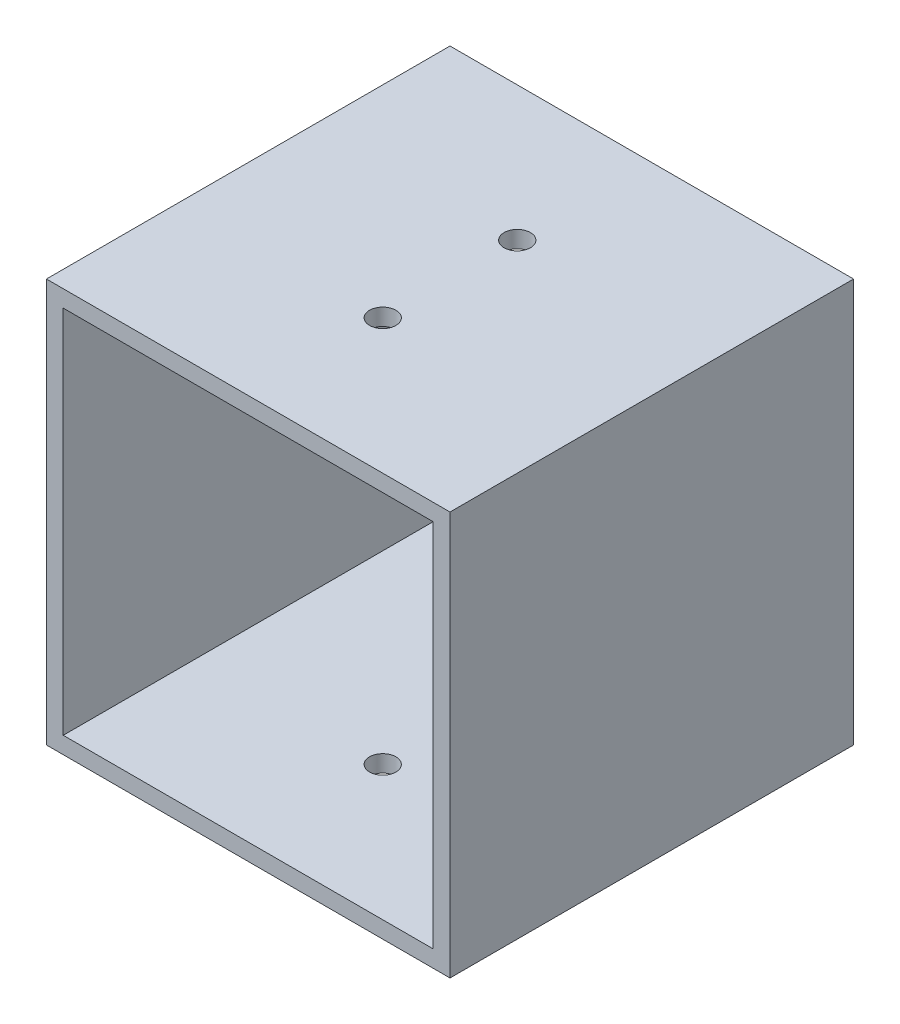
ISO-10303-21;
HEADER;
FILE_DESCRIPTION(('STEP AP214'),'2;1');
FILE_NAME('part.step','',(''),(''),'','','');
FILE_SCHEMA(('AUTOMOTIVE_DESIGN { 1 0 10303 214 1 1 1 1 }'));
ENDSEC;
DATA;
#1=APPLICATION_CONTEXT('core data for automotive mechanical design processes');
#2=APPLICATION_PROTOCOL_DEFINITION('international standard','automotive_design',2000,#1);
#3=PRODUCT_CONTEXT('',#1,'mechanical');
#4=PRODUCT('Part','Part','',(#3));
#5=PRODUCT_RELATED_PRODUCT_CATEGORY('part','',(#4));
#6=PRODUCT_DEFINITION_FORMATION('','',#4);
#7=PRODUCT_DEFINITION_CONTEXT('part definition',#1,'design');
#8=PRODUCT_DEFINITION('design','',#6,#7);
#9=PRODUCT_DEFINITION_SHAPE('','',#8);
#10=(LENGTH_UNIT() NAMED_UNIT(*) SI_UNIT(.MILLI.,.METRE.));
#11=(NAMED_UNIT(*) PLANE_ANGLE_UNIT() SI_UNIT($,.RADIAN.));
#12=(NAMED_UNIT(*) SI_UNIT($,.STERADIAN.) SOLID_ANGLE_UNIT());
#13=UNCERTAINTY_MEASURE_WITH_UNIT(LENGTH_MEASURE(1.E-05),#10,'distance_accuracy_value','');
#14=(GEOMETRIC_REPRESENTATION_CONTEXT(3) GLOBAL_UNCERTAINTY_ASSIGNED_CONTEXT((#13)) GLOBAL_UNIT_ASSIGNED_CONTEXT((#10,
#11,#12)) REPRESENTATION_CONTEXT('',''));
#15=CARTESIAN_POINT('',(0.,0.,0.));
#16=DIRECTION('',(0.,0.,1.));
#17=DIRECTION('',(1.,0.,0.));
#18=AXIS2_PLACEMENT_3D('',#15,#16,#17);
#19=CARTESIAN_POINT('',(0.,0.,38.1));
#20=DIRECTION('',(0.,0.,1.));
#21=DIRECTION('',(1.,0.,0.));
#22=AXIS2_PLACEMENT_3D('',#19,#20,#21);
#23=PLANE('',#22);
#24=DIRECTION('',(0.,1.,0.));
#25=VECTOR('',#24,1.);
#26=CARTESIAN_POINT('',(38.1,-38.1,38.1));
#27=LINE('',#26,#25);
#28=CARTESIAN_POINT('',(38.1,-38.1,38.1));
#29=VERTEX_POINT('',#28);
#30=CARTESIAN_POINT('',(38.1,38.1,38.1));
#31=VERTEX_POINT('',#30);
#32=EDGE_CURVE('E179',#29,#31,#27,.T.);
#33=ORIENTED_EDGE('',*,*,#32,.T.);
#34=DIRECTION('',(-1.,0.,0.));
#35=VECTOR('',#34,1.);
#36=CARTESIAN_POINT('',(-38.1,38.1,38.1));
#37=LINE('',#36,#35);
#38=CARTESIAN_POINT('',(-38.1,38.1,38.1));
#39=VERTEX_POINT('',#38);
#40=EDGE_CURVE('E183',#31,#39,#37,.T.);
#41=ORIENTED_EDGE('',*,*,#40,.T.);
#42=DIRECTION('',(0.,-1.,0.));
#43=VECTOR('',#42,1.);
#44=CARTESIAN_POINT('',(-38.1,-38.1,38.1));
#45=LINE('',#44,#43);
#46=CARTESIAN_POINT('',(-38.1,-38.1,38.1));
#47=VERTEX_POINT('',#46);
#48=EDGE_CURVE('E187',#39,#47,#45,.T.);
#49=ORIENTED_EDGE('',*,*,#48,.T.);
#50=DIRECTION('',(1.,0.,0.));
#51=VECTOR('',#50,1.);
#52=CARTESIAN_POINT('',(-38.1,-38.1,38.1));
#53=LINE('',#52,#51);
#54=EDGE_CURVE('E190',#47,#29,#53,.T.);
#55=ORIENTED_EDGE('',*,*,#54,.T.);
#56=EDGE_LOOP('',(#33,#41,#49,#55));
#57=FACE_BOUND('',#56,.T.);
#58=DIRECTION('',(-1.,0.,0.));
#59=VECTOR('',#58,1.);
#60=CARTESIAN_POINT('',(0.,34.925,38.1));
#61=LINE('',#60,#59);
#62=CARTESIAN_POINT('',(34.925,34.925,38.1));
#63=VERTEX_POINT('',#62);
#64=CARTESIAN_POINT('',(-34.925,34.925,38.1));
#65=VERTEX_POINT('',#64);
#66=EDGE_CURVE('E138',#63,#65,#61,.T.);
#67=ORIENTED_EDGE('',*,*,#66,.F.);
#68=DIRECTION('',(0.,1.,0.));
#69=VECTOR('',#68,1.);
#70=CARTESIAN_POINT('',(34.925,0.,38.1));
#71=LINE('',#70,#69);
#72=CARTESIAN_POINT('',(34.925,-34.925,38.1));
#73=VERTEX_POINT('',#72);
#74=EDGE_CURVE('E129',#73,#63,#71,.T.);
#75=ORIENTED_EDGE('',*,*,#74,.F.);
#76=DIRECTION('',(1.,0.,0.));
#77=VECTOR('',#76,1.);
#78=CARTESIAN_POINT('',(0.,-34.925,38.1));
#79=LINE('',#78,#77);
#80=CARTESIAN_POINT('',(-34.925,-34.925,38.1));
#81=VERTEX_POINT('',#80);
#82=EDGE_CURVE('E155',#81,#73,#79,.T.);
#83=ORIENTED_EDGE('',*,*,#82,.F.);
#84=DIRECTION('',(0.,-1.,0.));
#85=VECTOR('',#84,1.);
#86=CARTESIAN_POINT('',(-34.925,0.,38.1));
#87=LINE('',#86,#85);
#88=EDGE_CURVE('E151',#65,#81,#87,.T.);
#89=ORIENTED_EDGE('',*,*,#88,.F.);
#90=EDGE_LOOP('',(#67,#75,#83,#89));
#91=FACE_BOUND('',#90,.T.);
#92=ADVANCED_FACE('F61',(#57,#91),#23,.T.);
#93=CARTESIAN_POINT('',(0.,0.,-38.1));
#94=DIRECTION('',(0.,0.,1.));
#95=DIRECTION('',(1.,0.,0.));
#96=AXIS2_PLACEMENT_3D('',#93,#94,#95);
#97=PLANE('',#96);
#98=DIRECTION('',(0.,1.,0.));
#99=VECTOR('',#98,1.);
#100=CARTESIAN_POINT('',(38.1,-38.1,-38.1));
#101=LINE('',#100,#99);
#102=CARTESIAN_POINT('',(38.1,-38.1,-38.1));
#103=VERTEX_POINT('',#102);
#104=CARTESIAN_POINT('',(38.1,38.1,-38.1));
#105=VERTEX_POINT('',#104);
#106=EDGE_CURVE('E147',#103,#105,#101,.T.);
#107=ORIENTED_EDGE('',*,*,#106,.F.);
#108=DIRECTION('',(1.,0.,0.));
#109=VECTOR('',#108,1.);
#110=CARTESIAN_POINT('',(-38.1,-38.1,-38.1));
#111=LINE('',#110,#109);
#112=CARTESIAN_POINT('',(-38.1,-38.1,-38.1));
#113=VERTEX_POINT('',#112);
#114=EDGE_CURVE('E184',#113,#103,#111,.T.);
#115=ORIENTED_EDGE('',*,*,#114,.F.);
#116=DIRECTION('',(0.,-1.,0.));
#117=VECTOR('',#116,1.);
#118=CARTESIAN_POINT('',(-38.1,-38.1,-38.1));
#119=LINE('',#118,#117);
#120=CARTESIAN_POINT('',(-38.1,38.1,-38.1));
#121=VERTEX_POINT('',#120);
#122=EDGE_CURVE('E200',#121,#113,#119,.T.);
#123=ORIENTED_EDGE('',*,*,#122,.F.);
#124=DIRECTION('',(-1.,0.,0.));
#125=VECTOR('',#124,1.);
#126=CARTESIAN_POINT('',(-38.1,38.1,-38.1));
#127=LINE('',#126,#125);
#128=EDGE_CURVE('E197',#105,#121,#127,.T.);
#129=ORIENTED_EDGE('',*,*,#128,.F.);
#130=EDGE_LOOP('',(#107,#115,#123,#129));
#131=FACE_BOUND('',#130,.T.);
#132=DIRECTION('',(0.,1.,0.));
#133=VECTOR('',#132,1.);
#134=CARTESIAN_POINT('',(34.925,0.,-38.1));
#135=LINE('',#134,#133);
#136=CARTESIAN_POINT('',(34.925,-34.925,-38.1));
#137=VERTEX_POINT('',#136);
#138=CARTESIAN_POINT('',(34.925,34.925,-38.1));
#139=VERTEX_POINT('',#138);
#140=EDGE_CURVE('E87',#137,#139,#135,.T.);
#141=ORIENTED_EDGE('',*,*,#140,.T.);
#142=DIRECTION('',(-1.,0.,0.));
#143=VECTOR('',#142,1.);
#144=CARTESIAN_POINT('',(0.,34.925,-38.1));
#145=LINE('',#144,#143);
#146=CARTESIAN_POINT('',(-34.925,34.925,-38.1));
#147=VERTEX_POINT('',#146);
#148=EDGE_CURVE('E145',#139,#147,#145,.T.);
#149=ORIENTED_EDGE('',*,*,#148,.T.);
#150=DIRECTION('',(0.,-1.,0.));
#151=VECTOR('',#150,1.);
#152=CARTESIAN_POINT('',(-34.925,0.,-38.1));
#153=LINE('',#152,#151);
#154=CARTESIAN_POINT('',(-34.925,-34.925,-38.1));
#155=VERTEX_POINT('',#154);
#156=EDGE_CURVE('E166',#147,#155,#153,.T.);
#157=ORIENTED_EDGE('',*,*,#156,.T.);
#158=DIRECTION('',(1.,0.,0.));
#159=VECTOR('',#158,1.);
#160=CARTESIAN_POINT('',(0.,-34.925,-38.1));
#161=LINE('',#160,#159);
#162=EDGE_CURVE('E139',#155,#137,#161,.T.);
#163=ORIENTED_EDGE('',*,*,#162,.T.);
#164=EDGE_LOOP('',(#141,#149,#157,#163));
#165=FACE_BOUND('',#164,.T.);
#166=ADVANCED_FACE('F260',(#131,#165),#97,.F.);
#167=CARTESIAN_POINT('',(38.1,-38.1,38.1));
#168=DIRECTION('',(-1.,0.,0.));
#169=DIRECTION('',(0.,0.,1.));
#170=AXIS2_PLACEMENT_3D('',#167,#168,#169);
#171=PLANE('',#170);
#172=ORIENTED_EDGE('',*,*,#106,.T.);
#173=DIRECTION('',(0.,0.,-1.));
#174=VECTOR('',#173,1.);
#175=CARTESIAN_POINT('',(38.1,38.1,38.1));
#176=LINE('',#175,#174);
#177=EDGE_CURVE('E12',#31,#105,#176,.T.);
#178=ORIENTED_EDGE('',*,*,#177,.F.);
#179=ORIENTED_EDGE('',*,*,#32,.F.);
#180=DIRECTION('',(0.,0.,-1.));
#181=VECTOR('',#180,1.);
#182=CARTESIAN_POINT('',(38.1,-38.1,38.1));
#183=LINE('',#182,#181);
#184=EDGE_CURVE('E193',#29,#103,#183,.T.);
#185=ORIENTED_EDGE('',*,*,#184,.T.);
#186=EDGE_LOOP('',(#172,#178,#179,#185));
#187=FACE_BOUND('',#186,.T.);
#188=ADVANCED_FACE('F63',(#187),#171,.F.);
#189=CARTESIAN_POINT('',(-38.1,38.1,38.1));
#190=DIRECTION('',(0.,-1.,0.));
#191=DIRECTION('',(0.,0.,-1.));
#192=AXIS2_PLACEMENT_3D('',#189,#190,#191);
#193=PLANE('',#192);
#194=CARTESIAN_POINT('',(0.,38.1,12.7));
#195=DIRECTION('',(0.,-1.,0.));
#196=DIRECTION('',(0.,0.,-1.));
#197=AXIS2_PLACEMENT_3D('',#194,#195,#196);
#198=CIRCLE('',#197,2.4892);
#199=CARTESIAN_POINT('',(0.,38.1,10.2108));
#200=VERTEX_POINT('',#199);
#201=EDGE_CURVE('E218',#200,#200,#198,.T.);
#202=ORIENTED_EDGE('',*,*,#201,.T.);
#203=EDGE_LOOP('',(#202));
#204=FACE_BOUND('',#203,.T.);
#205=CARTESIAN_POINT('',(0.,38.1,-12.7));
#206=DIRECTION('',(0.,-1.,0.));
#207=DIRECTION('',(0.,0.,-1.));
#208=AXIS2_PLACEMENT_3D('',#205,#206,#207);
#209=CIRCLE('',#208,2.4892);
#210=CARTESIAN_POINT('',(0.,38.1,-15.1892));
#211=VERTEX_POINT('',#210);
#212=EDGE_CURVE('E232',#211,#211,#209,.T.);
#213=ORIENTED_EDGE('',*,*,#212,.T.);
#214=EDGE_LOOP('',(#213));
#215=FACE_BOUND('',#214,.T.);
#216=ORIENTED_EDGE('',*,*,#128,.T.);
#217=DIRECTION('',(0.,0.,-1.));
#218=VECTOR('',#217,1.);
#219=CARTESIAN_POINT('',(-38.1,38.1,38.1));
#220=LINE('',#219,#218);
#221=EDGE_CURVE('E71',#39,#121,#220,.T.);
#222=ORIENTED_EDGE('',*,*,#221,.F.);
#223=ORIENTED_EDGE('',*,*,#40,.F.);
#224=ORIENTED_EDGE('',*,*,#177,.T.);
#225=EDGE_LOOP('',(#216,#222,#223,#224));
#226=FACE_BOUND('',#225,.T.);
#227=ADVANCED_FACE('F285',(#204,#215,#226),#193,.F.);
#228=CARTESIAN_POINT('',(-38.1,-38.1,38.1));
#229=DIRECTION('',(1.,0.,0.));
#230=DIRECTION('',(0.,0.,-1.));
#231=AXIS2_PLACEMENT_3D('',#228,#229,#230);
#232=PLANE('',#231);
#233=ORIENTED_EDGE('',*,*,#122,.T.);
#234=DIRECTION('',(0.,0.,-1.));
#235=VECTOR('',#234,1.);
#236=CARTESIAN_POINT('',(-38.1,-38.1,38.1));
#237=LINE('',#236,#235);
#238=EDGE_CURVE('E208',#47,#113,#237,.T.);
#239=ORIENTED_EDGE('',*,*,#238,.F.);
#240=ORIENTED_EDGE('',*,*,#48,.F.);
#241=ORIENTED_EDGE('',*,*,#221,.T.);
#242=EDGE_LOOP('',(#233,#239,#240,#241));
#243=FACE_BOUND('',#242,.T.);
#244=ADVANCED_FACE('F282',(#243),#232,.F.);
#245=CARTESIAN_POINT('',(-38.1,-38.1,38.1));
#246=DIRECTION('',(0.,1.,0.));
#247=DIRECTION('',(0.,0.,1.));
#248=AXIS2_PLACEMENT_3D('',#245,#246,#247);
#249=PLANE('',#248);
#250=CARTESIAN_POINT('',(0.,-38.1,12.7));
#251=DIRECTION('',(0.,-1.,0.));
#252=DIRECTION('',(0.,0.,-1.));
#253=AXIS2_PLACEMENT_3D('',#250,#251,#252);
#254=CIRCLE('',#253,2.4892);
#255=CARTESIAN_POINT('',(0.,-38.1,10.2108));
#256=VERTEX_POINT('',#255);
#257=EDGE_CURVE('E226',#256,#256,#254,.T.);
#258=ORIENTED_EDGE('',*,*,#257,.F.);
#259=EDGE_LOOP('',(#258));
#260=FACE_BOUND('',#259,.T.);
#261=CARTESIAN_POINT('',(0.,-38.1,-12.7));
#262=DIRECTION('',(0.,-1.,0.));
#263=DIRECTION('',(0.,0.,-1.));
#264=AXIS2_PLACEMENT_3D('',#261,#262,#263);
#265=CIRCLE('',#264,2.4892);
#266=CARTESIAN_POINT('',(0.,-38.1,-15.1892));
#267=VERTEX_POINT('',#266);
#268=EDGE_CURVE('E238',#267,#267,#265,.T.);
#269=ORIENTED_EDGE('',*,*,#268,.F.);
#270=EDGE_LOOP('',(#269));
#271=FACE_BOUND('',#270,.T.);
#272=ORIENTED_EDGE('',*,*,#114,.T.);
#273=ORIENTED_EDGE('',*,*,#184,.F.);
#274=ORIENTED_EDGE('',*,*,#54,.F.);
#275=ORIENTED_EDGE('',*,*,#238,.T.);
#276=EDGE_LOOP('',(#272,#273,#274,#275));
#277=FACE_BOUND('',#276,.T.);
#278=ADVANCED_FACE('F279',(#260,#271,#277),#249,.F.);
#279=CARTESIAN_POINT('',(34.925,0.,38.1));
#280=DIRECTION('',(-1.,0.,0.));
#281=DIRECTION('',(0.,0.,1.));
#282=AXIS2_PLACEMENT_3D('',#279,#280,#281);
#283=PLANE('',#282);
#284=ORIENTED_EDGE('',*,*,#140,.F.);
#285=DIRECTION('',(0.,0.,-1.));
#286=VECTOR('',#285,1.);
#287=CARTESIAN_POINT('',(34.925,-34.925,38.1));
#288=LINE('',#287,#286);
#289=EDGE_CURVE('E133',#73,#137,#288,.T.);
#290=ORIENTED_EDGE('',*,*,#289,.F.);
#291=ORIENTED_EDGE('',*,*,#74,.T.);
#292=DIRECTION('',(0.,0.,-1.));
#293=VECTOR('',#292,1.);
#294=CARTESIAN_POINT('',(34.925,34.925,38.1));
#295=LINE('',#294,#293);
#296=EDGE_CURVE('E132',#63,#139,#295,.T.);
#297=ORIENTED_EDGE('',*,*,#296,.T.);
#298=EDGE_LOOP('',(#284,#290,#291,#297));
#299=FACE_BOUND('',#298,.T.);
#300=ADVANCED_FACE('F131',(#299),#283,.T.);
#301=CARTESIAN_POINT('',(0.,34.925,38.1));
#302=DIRECTION('',(0.,-1.,0.));
#303=DIRECTION('',(0.,0.,-1.));
#304=AXIS2_PLACEMENT_3D('',#301,#302,#303);
#305=PLANE('',#304);
#306=CARTESIAN_POINT('',(0.,34.925,12.7));
#307=DIRECTION('',(0.,-1.,0.));
#308=DIRECTION('',(0.,0.,-1.));
#309=AXIS2_PLACEMENT_3D('',#306,#307,#308);
#310=CIRCLE('',#309,2.4892);
#311=CARTESIAN_POINT('',(0.,34.925,10.2108));
#312=VERTEX_POINT('',#311);
#313=EDGE_CURVE('E163',#312,#312,#310,.T.);
#314=ORIENTED_EDGE('',*,*,#313,.F.);
#315=EDGE_LOOP('',(#314));
#316=FACE_BOUND('',#315,.T.);
#317=CARTESIAN_POINT('',(0.,34.925,-12.7));
#318=DIRECTION('',(0.,-1.,0.));
#319=DIRECTION('',(0.,0.,-1.));
#320=AXIS2_PLACEMENT_3D('',#317,#318,#319);
#321=CIRCLE('',#320,2.4892);
#322=CARTESIAN_POINT('',(0.,34.925,-15.1892));
#323=VERTEX_POINT('',#322);
#324=EDGE_CURVE('E217',#323,#323,#321,.T.);
#325=ORIENTED_EDGE('',*,*,#324,.F.);
#326=EDGE_LOOP('',(#325));
#327=FACE_BOUND('',#326,.T.);
#328=ORIENTED_EDGE('',*,*,#148,.F.);
#329=ORIENTED_EDGE('',*,*,#296,.F.);
#330=ORIENTED_EDGE('',*,*,#66,.T.);
#331=DIRECTION('',(0.,0.,-1.));
#332=VECTOR('',#331,1.);
#333=CARTESIAN_POINT('',(-34.925,34.925,38.1));
#334=LINE('',#333,#332);
#335=EDGE_CURVE('E148',#65,#147,#334,.T.);
#336=ORIENTED_EDGE('',*,*,#335,.T.);
#337=EDGE_LOOP('',(#328,#329,#330,#336));
#338=FACE_BOUND('',#337,.T.);
#339=ADVANCED_FACE('F142',(#316,#327,#338),#305,.T.);
#340=CARTESIAN_POINT('',(-34.925,0.,38.1));
#341=DIRECTION('',(1.,0.,0.));
#342=DIRECTION('',(0.,0.,-1.));
#343=AXIS2_PLACEMENT_3D('',#340,#341,#342);
#344=PLANE('',#343);
#345=ORIENTED_EDGE('',*,*,#156,.F.);
#346=ORIENTED_EDGE('',*,*,#335,.F.);
#347=ORIENTED_EDGE('',*,*,#88,.T.);
#348=DIRECTION('',(0.,0.,-1.));
#349=VECTOR('',#348,1.);
#350=CARTESIAN_POINT('',(-34.925,-34.925,38.1));
#351=LINE('',#350,#349);
#352=EDGE_CURVE('E79',#81,#155,#351,.T.);
#353=ORIENTED_EDGE('',*,*,#352,.T.);
#354=EDGE_LOOP('',(#345,#346,#347,#353));
#355=FACE_BOUND('',#354,.T.);
#356=ADVANCED_FACE('F256',(#355),#344,.T.);
#357=CARTESIAN_POINT('',(0.,-34.925,38.1));
#358=DIRECTION('',(0.,1.,0.));
#359=DIRECTION('',(0.,0.,1.));
#360=AXIS2_PLACEMENT_3D('',#357,#358,#359);
#361=PLANE('',#360);
#362=CARTESIAN_POINT('',(0.,-34.925,12.7));
#363=DIRECTION('',(0.,1.,0.));
#364=DIRECTION('',(0.,0.,1.));
#365=AXIS2_PLACEMENT_3D('',#362,#363,#364);
#366=CIRCLE('',#365,2.4892);
#367=CARTESIAN_POINT('',(0.,-34.925,15.1892));
#368=VERTEX_POINT('',#367);
#369=EDGE_CURVE('E65',#368,#368,#366,.T.);
#370=ORIENTED_EDGE('',*,*,#369,.F.);
#371=EDGE_LOOP('',(#370));
#372=FACE_BOUND('',#371,.T.);
#373=CARTESIAN_POINT('',(0.,-34.925,-12.7));
#374=DIRECTION('',(0.,1.,0.));
#375=DIRECTION('',(0.,0.,1.));
#376=AXIS2_PLACEMENT_3D('',#373,#374,#375);
#377=CIRCLE('',#376,2.4892);
#378=CARTESIAN_POINT('',(0.,-34.925,-10.2108));
#379=VERTEX_POINT('',#378);
#380=EDGE_CURVE('E214',#379,#379,#377,.T.);
#381=ORIENTED_EDGE('',*,*,#380,.F.);
#382=EDGE_LOOP('',(#381));
#383=FACE_BOUND('',#382,.T.);
#384=ORIENTED_EDGE('',*,*,#162,.F.);
#385=ORIENTED_EDGE('',*,*,#352,.F.);
#386=ORIENTED_EDGE('',*,*,#82,.T.);
#387=ORIENTED_EDGE('',*,*,#289,.T.);
#388=EDGE_LOOP('',(#384,#385,#386,#387));
#389=FACE_BOUND('',#388,.T.);
#390=ADVANCED_FACE('F252',(#372,#383,#389),#361,.T.);
#391=CARTESIAN_POINT('',(0.,38.1,-12.7));
#392=DIRECTION('',(0.,-1.,0.));
#393=DIRECTION('',(0.,0.,-1.));
#394=AXIS2_PLACEMENT_3D('',#391,#392,#393);
#395=CYLINDRICAL_SURFACE('',#394,2.4892);
#396=ORIENTED_EDGE('',*,*,#380,.T.);
#397=EDGE_LOOP('',(#396));
#398=FACE_BOUND('',#397,.T.);
#399=ORIENTED_EDGE('',*,*,#268,.T.);
#400=EDGE_LOOP('',(#399));
#401=FACE_BOUND('',#400,.T.);
#402=ADVANCED_FACE('F255',(#398,#401),#395,.F.);
#403=CARTESIAN_POINT('',(0.,38.1,12.7));
#404=DIRECTION('',(0.,-1.,0.));
#405=DIRECTION('',(0.,0.,-1.));
#406=AXIS2_PLACEMENT_3D('',#403,#404,#405);
#407=CYLINDRICAL_SURFACE('',#406,2.4892);
#408=ORIENTED_EDGE('',*,*,#369,.T.);
#409=EDGE_LOOP('',(#408));
#410=FACE_BOUND('',#409,.T.);
#411=ORIENTED_EDGE('',*,*,#257,.T.);
#412=EDGE_LOOP('',(#411));
#413=FACE_BOUND('',#412,.T.);
#414=ADVANCED_FACE('F249',(#410,#413),#407,.F.);
#415=ORIENTED_EDGE('',*,*,#324,.T.);
#416=EDGE_LOOP('',(#415));
#417=FACE_BOUND('',#416,.T.);
#418=ORIENTED_EDGE('',*,*,#212,.F.);
#419=EDGE_LOOP('',(#418));
#420=FACE_BOUND('',#419,.T.);
#421=ADVANCED_FACE('F307',(#417,#420),#395,.F.);
#422=ORIENTED_EDGE('',*,*,#313,.T.);
#423=EDGE_LOOP('',(#422));
#424=FACE_BOUND('',#423,.T.);
#425=ORIENTED_EDGE('',*,*,#201,.F.);
#426=EDGE_LOOP('',(#425));
#427=FACE_BOUND('',#426,.T.);
#428=ADVANCED_FACE('F309',(#424,#427),#407,.F.);
#429=CLOSED_SHELL('',(#92,#166,#188,#227,#244,#278,#300,#339,#356,#390,#402,#414,#421,#428));
#430=MANIFOLD_SOLID_BREP('B2',#429);
#431=ADVANCED_BREP_SHAPE_REPRESENTATION('',(#18,#430),#14);
#432=SHAPE_DEFINITION_REPRESENTATION(#9,#431);
ENDSEC;
END-ISO-10303-21;
